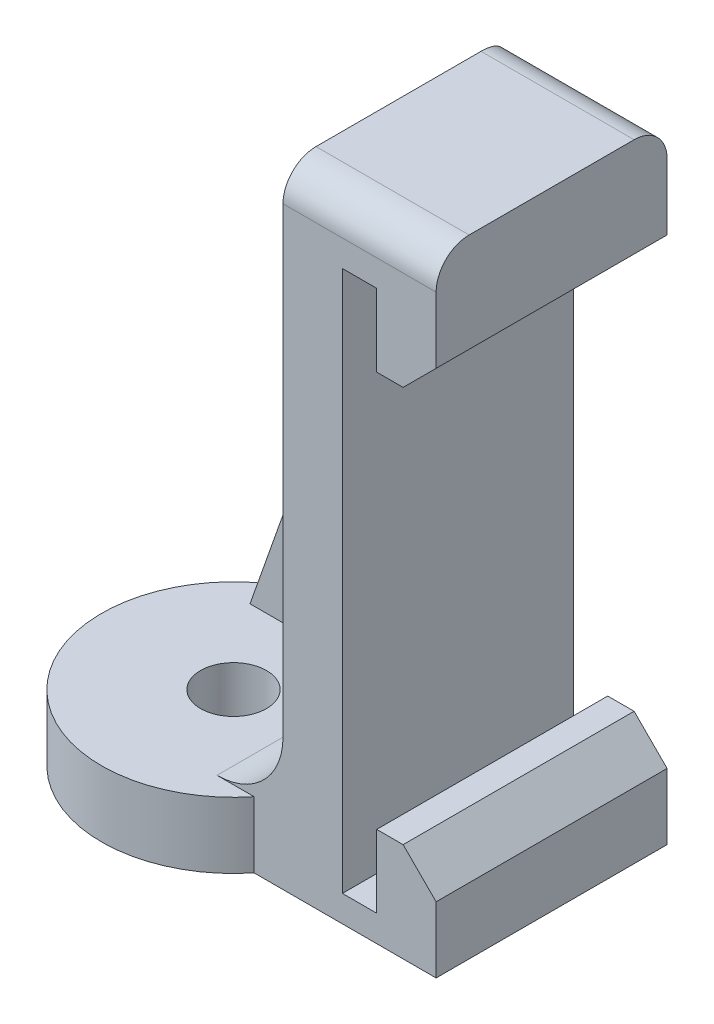
ISO-10303-21;
HEADER;
FILE_DESCRIPTION(('STEP AP214'),'2;1');
FILE_NAME('part.step','',(''),(''),'','','');
FILE_SCHEMA(('AUTOMOTIVE_DESIGN { 1 0 10303 214 1 1 1 1 }'));
ENDSEC;
DATA;
#1=APPLICATION_CONTEXT('core data for automotive mechanical design processes');
#2=APPLICATION_PROTOCOL_DEFINITION('international standard','automotive_design',2000,#1);
#3=PRODUCT_CONTEXT('',#1,'mechanical');
#4=PRODUCT('Part','Part','',(#3));
#5=PRODUCT_RELATED_PRODUCT_CATEGORY('part','',(#4));
#6=PRODUCT_DEFINITION_FORMATION('','',#4);
#7=PRODUCT_DEFINITION_CONTEXT('part definition',#1,'design');
#8=PRODUCT_DEFINITION('design','',#6,#7);
#9=PRODUCT_DEFINITION_SHAPE('','',#8);
#10=(LENGTH_UNIT() NAMED_UNIT(*) SI_UNIT(.MILLI.,.METRE.));
#11=(NAMED_UNIT(*) PLANE_ANGLE_UNIT() SI_UNIT($,.RADIAN.));
#12=(NAMED_UNIT(*) SI_UNIT($,.STERADIAN.) SOLID_ANGLE_UNIT());
#13=UNCERTAINTY_MEASURE_WITH_UNIT(LENGTH_MEASURE(1.E-05),#10,'distance_accuracy_value','');
#14=(GEOMETRIC_REPRESENTATION_CONTEXT(3) GLOBAL_UNCERTAINTY_ASSIGNED_CONTEXT((#13)) GLOBAL_UNIT_ASSIGNED_CONTEXT((#10,
#11,#12)) REPRESENTATION_CONTEXT('',''));
#15=CARTESIAN_POINT('',(0.,0.,0.));
#16=DIRECTION('',(0.,0.,1.));
#17=DIRECTION('',(1.,0.,0.));
#18=AXIS2_PLACEMENT_3D('',#15,#16,#17);
#19=CARTESIAN_POINT('',(1.3335,-0.3175,9.525));
#20=DIRECTION('',(0.,-1.,0.));
#21=DIRECTION('',(0.,0.,-1.));
#22=AXIS2_PLACEMENT_3D('',#19,#20,#21);
#23=PLANE('',#22);
#24=DIRECTION('',(1.,0.,0.));
#25=VECTOR('',#24,1.);
#26=CARTESIAN_POINT('',(1.3335,-0.3175,-1.5875));
#27=LINE('',#26,#25);
#28=CARTESIAN_POINT('',(-0.3175,-0.3175,-1.5875));
#29=VERTEX_POINT('',#28);
#30=CARTESIAN_POINT('',(1.3335,-0.3175,-1.5875));
#31=VERTEX_POINT('',#30);
#32=EDGE_CURVE('E228',#29,#31,#27,.T.);
#33=ORIENTED_EDGE('',*,*,#32,.F.);
#34=DIRECTION('',(0.,0.,-1.));
#35=VECTOR('',#34,1.);
#36=CARTESIAN_POINT('',(-0.3175,-0.3175,9.525));
#37=LINE('',#36,#35);
#38=CARTESIAN_POINT('',(-0.3175,-0.3175,9.525));
#39=VERTEX_POINT('',#38);
#40=EDGE_CURVE('E301',#39,#29,#37,.T.);
#41=ORIENTED_EDGE('',*,*,#40,.F.);
#42=DIRECTION('',(-1.,0.,0.));
#43=VECTOR('',#42,1.);
#44=CARTESIAN_POINT('',(1.3335,-0.3175,9.525));
#45=LINE('',#44,#43);
#46=CARTESIAN_POINT('',(1.3335,-0.3175,9.525));
#47=VERTEX_POINT('',#46);
#48=EDGE_CURVE('E251',#47,#39,#45,.T.);
#49=ORIENTED_EDGE('',*,*,#48,.F.);
#50=DIRECTION('',(0.,0.,-1.));
#51=VECTOR('',#50,1.);
#52=CARTESIAN_POINT('',(1.3335,-0.3175,9.525));
#53=LINE('',#52,#51);
#54=EDGE_CURVE('E277',#47,#31,#53,.T.);
#55=ORIENTED_EDGE('',*,*,#54,.T.);
#56=EDGE_LOOP('',(#33,#41,#49,#55));
#57=FACE_BOUND('',#56,.T.);
#58=ADVANCED_FACE('F35',(#57),#23,.F.);
#59=CARTESIAN_POINT('',(-0.3175,-0.3175,9.525));
#60=DIRECTION('',(-1.,0.,0.));
#61=DIRECTION('',(0.,0.,1.));
#62=AXIS2_PLACEMENT_3D('',#59,#60,#61);
#63=PLANE('',#62);
#64=DIRECTION('',(0.,-1.,0.));
#65=VECTOR('',#64,1.);
#66=CARTESIAN_POINT('',(-0.3175,-0.3175,-1.5875));
#67=LINE('',#66,#65);
#68=CARTESIAN_POINT('',(-0.3175,25.7175,-1.5875));
#69=VERTEX_POINT('',#68);
#70=EDGE_CURVE('E226',#69,#29,#67,.T.);
#71=ORIENTED_EDGE('',*,*,#70,.F.);
#72=DIRECTION('',(0.,0.,-1.));
#73=VECTOR('',#72,1.);
#74=CARTESIAN_POINT('',(-0.3175,25.7175,9.525));
#75=LINE('',#74,#73);
#76=CARTESIAN_POINT('',(-0.3175,25.7175,9.525));
#77=VERTEX_POINT('',#76);
#78=EDGE_CURVE('E298',#77,#69,#75,.T.);
#79=ORIENTED_EDGE('',*,*,#78,.F.);
#80=DIRECTION('',(0.,1.,0.));
#81=VECTOR('',#80,1.);
#82=CARTESIAN_POINT('',(-0.3175,-0.3175,9.525));
#83=LINE('',#82,#81);
#84=EDGE_CURVE('E254',#39,#77,#83,.T.);
#85=ORIENTED_EDGE('',*,*,#84,.F.);
#86=ORIENTED_EDGE('',*,*,#40,.T.);
#87=EDGE_LOOP('',(#71,#79,#85,#86));
#88=FACE_BOUND('',#87,.T.);
#89=ADVANCED_FACE('F380',(#88),#63,.F.);
#90=CARTESIAN_POINT('',(-0.3175,25.7175,9.525));
#91=DIRECTION('',(0.,1.,0.));
#92=DIRECTION('',(0.,0.,1.));
#93=AXIS2_PLACEMENT_3D('',#90,#91,#92);
#94=PLANE('',#93);
#95=DIRECTION('',(-1.,0.,0.));
#96=VECTOR('',#95,1.);
#97=CARTESIAN_POINT('',(-0.3175,25.7175,-1.5875));
#98=LINE('',#97,#96);
#99=CARTESIAN_POINT('',(1.3335,25.7175,-1.5875));
#100=VERTEX_POINT('',#99);
#101=EDGE_CURVE('E224',#100,#69,#98,.T.);
#102=ORIENTED_EDGE('',*,*,#101,.F.);
#103=DIRECTION('',(0.,0.,-1.));
#104=VECTOR('',#103,1.);
#105=CARTESIAN_POINT('',(1.3335,25.7175,9.525));
#106=LINE('',#105,#104);
#107=CARTESIAN_POINT('',(1.3335,25.7175,9.525));
#108=VERTEX_POINT('',#107);
#109=EDGE_CURVE('E295',#108,#100,#106,.T.);
#110=ORIENTED_EDGE('',*,*,#109,.F.);
#111=DIRECTION('',(1.,0.,0.));
#112=VECTOR('',#111,1.);
#113=CARTESIAN_POINT('',(-0.3175,25.7175,9.525));
#114=LINE('',#113,#112);
#115=EDGE_CURVE('E256',#77,#108,#114,.T.);
#116=ORIENTED_EDGE('',*,*,#115,.F.);
#117=ORIENTED_EDGE('',*,*,#78,.T.);
#118=EDGE_LOOP('',(#102,#110,#116,#117));
#119=FACE_BOUND('',#118,.T.);
#120=ADVANCED_FACE('F376',(#119),#94,.F.);
#121=CARTESIAN_POINT('',(1.3335,25.7175,9.525));
#122=DIRECTION('',(1.,0.,0.));
#123=DIRECTION('',(0.,1.,0.));
#124=AXIS2_PLACEMENT_3D('',#121,#122,#123);
#125=PLANE('',#124);
#126=DIRECTION('',(0.,1.,0.));
#127=VECTOR('',#126,1.);
#128=CARTESIAN_POINT('',(1.3335,25.7175,-1.5875));
#129=LINE('',#128,#127);
#130=CARTESIAN_POINT('',(1.3335,22.225,-1.5875));
#131=VERTEX_POINT('',#130);
#132=EDGE_CURVE('E222',#131,#100,#129,.T.);
#133=ORIENTED_EDGE('',*,*,#132,.F.);
#134=DIRECTION('',(0.,0.,-1.));
#135=VECTOR('',#134,1.);
#136=CARTESIAN_POINT('',(1.3335,22.225,9.525));
#137=LINE('',#136,#135);
#138=CARTESIAN_POINT('',(1.3335,22.225,9.525));
#139=VERTEX_POINT('',#138);
#140=EDGE_CURVE('E292',#139,#131,#137,.T.);
#141=ORIENTED_EDGE('',*,*,#140,.F.);
#142=DIRECTION('',(0.,-1.,0.));
#143=VECTOR('',#142,1.);
#144=CARTESIAN_POINT('',(1.3335,25.7175,9.525));
#145=LINE('',#144,#143);
#146=EDGE_CURVE('E258',#108,#139,#145,.T.);
#147=ORIENTED_EDGE('',*,*,#146,.F.);
#148=ORIENTED_EDGE('',*,*,#109,.T.);
#149=EDGE_LOOP('',(#133,#141,#147,#148));
#150=FACE_BOUND('',#149,.T.);
#151=ADVANCED_FACE('F371',(#150),#125,.F.);
#152=CARTESIAN_POINT('',(4.191,22.225,9.525));
#153=DIRECTION('',(0.,1.,0.));
#154=DIRECTION('',(0.,0.,1.));
#155=AXIS2_PLACEMENT_3D('',#152,#153,#154);
#156=PLANE('',#155);
#157=DIRECTION('',(-1.,0.,0.));
#158=VECTOR('',#157,1.);
#159=CARTESIAN_POINT('',(4.191,22.225,-1.5875));
#160=LINE('',#159,#158);
#161=CARTESIAN_POINT('',(2.60349999999999,22.225,-1.5875));
#162=VERTEX_POINT('',#161);
#163=EDGE_CURVE('E220',#162,#131,#160,.T.);
#164=ORIENTED_EDGE('',*,*,#163,.F.);
#165=DIRECTION('',(0.,0.,1.));
#166=VECTOR('',#165,1.);
#167=CARTESIAN_POINT('',(2.60349999999999,22.225,9.525));
#168=LINE('',#167,#166);
#169=CARTESIAN_POINT('',(2.60349999999999,22.225,9.525));
#170=VERTEX_POINT('',#169);
#171=EDGE_CURVE('E325',#162,#170,#168,.T.);
#172=ORIENTED_EDGE('',*,*,#171,.T.);
#173=DIRECTION('',(1.,0.,0.));
#174=VECTOR('',#173,1.);
#175=CARTESIAN_POINT('',(4.191,22.225,9.525));
#176=LINE('',#175,#174);
#177=EDGE_CURVE('E260',#139,#170,#176,.T.);
#178=ORIENTED_EDGE('',*,*,#177,.F.);
#179=ORIENTED_EDGE('',*,*,#140,.T.);
#180=EDGE_LOOP('',(#164,#172,#178,#179));
#181=FACE_BOUND('',#180,.T.);
#182=ADVANCED_FACE('F366',(#181),#156,.F.);
#183=CARTESIAN_POINT('',(4.191,28.575,9.525));
#184=DIRECTION('',(-1.,0.,0.));
#185=DIRECTION('',(0.,0.,1.));
#186=AXIS2_PLACEMENT_3D('',#183,#184,#185);
#187=PLANE('',#186);
#188=DIRECTION('',(0.,-1.,0.));
#189=VECTOR('',#188,1.);
#190=CARTESIAN_POINT('',(4.191,28.575,-1.5875));
#191=LINE('',#190,#189);
#192=CARTESIAN_POINT('',(4.191,26.9875,-1.5875));
#193=VERTEX_POINT('',#192);
#194=CARTESIAN_POINT('',(4.191,23.8125,-1.5875));
#195=VERTEX_POINT('',#194);
#196=EDGE_CURVE('E215',#193,#195,#191,.T.);
#197=ORIENTED_EDGE('',*,*,#196,.F.);
#198=CARTESIAN_POINT('',(4.191,26.9875,0.));
#199=DIRECTION('',(-1.,0.,0.));
#200=DIRECTION('',(0.,0.,1.));
#201=AXIS2_PLACEMENT_3D('',#198,#199,#200);
#202=CIRCLE('',#201,1.5875);
#203=CARTESIAN_POINT('',(4.191,28.575,0.));
#204=VERTEX_POINT('',#203);
#205=EDGE_CURVE('E342',#193,#204,#202,.F.);
#206=ORIENTED_EDGE('',*,*,#205,.T.);
#207=DIRECTION('',(0.,0.,-1.));
#208=VECTOR('',#207,1.);
#209=CARTESIAN_POINT('',(4.191,28.575,9.525));
#210=LINE('',#209,#208);
#211=CARTESIAN_POINT('',(4.191,28.575,7.9375));
#212=VERTEX_POINT('',#211);
#213=EDGE_CURVE('E289',#212,#204,#210,.T.);
#214=ORIENTED_EDGE('',*,*,#213,.F.);
#215=CARTESIAN_POINT('',(4.191,26.9875,7.9375));
#216=DIRECTION('',(-1.,0.,0.));
#217=DIRECTION('',(0.,0.,1.));
#218=AXIS2_PLACEMENT_3D('',#215,#216,#217);
#219=CIRCLE('',#218,1.5875);
#220=CARTESIAN_POINT('',(4.191,26.9875,9.525));
#221=VERTEX_POINT('',#220);
#222=EDGE_CURVE('E329',#212,#221,#219,.F.);
#223=ORIENTED_EDGE('',*,*,#222,.T.);
#224=DIRECTION('',(0.,1.,0.));
#225=VECTOR('',#224,1.);
#226=CARTESIAN_POINT('',(4.191,28.575,9.525));
#227=LINE('',#226,#225);
#228=CARTESIAN_POINT('',(4.191,23.8125,9.525));
#229=VERTEX_POINT('',#228);
#230=EDGE_CURVE('E263',#229,#221,#227,.T.);
#231=ORIENTED_EDGE('',*,*,#230,.F.);
#232=DIRECTION('',(0.,0.,-1.));
#233=VECTOR('',#232,1.);
#234=CARTESIAN_POINT('',(4.191,23.8125,9.525));
#235=LINE('',#234,#233);
#236=EDGE_CURVE('E322',#229,#195,#235,.T.);
#237=ORIENTED_EDGE('',*,*,#236,.T.);
#238=EDGE_LOOP('',(#197,#206,#214,#223,#231,#237));
#239=FACE_BOUND('',#238,.T.);
#240=ADVANCED_FACE('F356',(#239),#187,.F.);
#241=CARTESIAN_POINT('',(1.016,28.575,9.525));
#242=DIRECTION('',(0.,-1.,0.));
#243=DIRECTION('',(0.,0.,-1.));
#244=AXIS2_PLACEMENT_3D('',#241,#242,#243);
#245=PLANE('',#244);
#246=ORIENTED_EDGE('',*,*,#213,.T.);
#247=DIRECTION('',(1.,0.,0.));
#248=VECTOR('',#247,1.);
#249=CARTESIAN_POINT('',(-3.175,28.575,0.));
#250=LINE('',#249,#248);
#251=CARTESIAN_POINT('',(-3.175,28.575,0.));
#252=VERTEX_POINT('',#251);
#253=EDGE_CURVE('E43',#204,#252,#250,.F.);
#254=ORIENTED_EDGE('',*,*,#253,.T.);
#255=DIRECTION('',(0.,0.,-1.));
#256=VECTOR('',#255,1.);
#257=CARTESIAN_POINT('',(-3.175,28.575,1.5875));
#258=LINE('',#257,#256);
#259=CARTESIAN_POINT('',(-3.175,28.575,1.5875));
#260=VERTEX_POINT('',#259);
#261=EDGE_CURVE('E205',#260,#252,#258,.T.);
#262=ORIENTED_EDGE('',*,*,#261,.F.);
#263=DIRECTION('',(0.,0.,-1.));
#264=VECTOR('',#263,1.);
#265=CARTESIAN_POINT('',(-3.175,28.575,9.525));
#266=LINE('',#265,#264);
#267=CARTESIAN_POINT('',(-3.175,28.575,7.9375));
#268=VERTEX_POINT('',#267);
#269=EDGE_CURVE('E287',#268,#260,#266,.T.);
#270=ORIENTED_EDGE('',*,*,#269,.F.);
#271=DIRECTION('',(-1.,0.,0.));
#272=VECTOR('',#271,1.);
#273=CARTESIAN_POINT('',(1.016,28.575,7.9375));
#274=LINE('',#273,#272);
#275=EDGE_CURVE('E327',#268,#212,#274,.F.);
#276=ORIENTED_EDGE('',*,*,#275,.T.);
#277=EDGE_LOOP('',(#246,#254,#262,#270,#276));
#278=FACE_BOUND('',#277,.T.);
#279=ADVANCED_FACE('F346',(#278),#245,.F.);
#280=CARTESIAN_POINT('',(-12.7,-1.5875,9.525));
#281=DIRECTION('',(1.,0.,0.));
#282=DIRECTION('',(0.,0.,-1.));
#283=AXIS2_PLACEMENT_3D('',#280,#281,#282);
#284=PLANE('',#283);
#285=DIRECTION('',(0.,0.,-1.));
#286=VECTOR('',#285,1.);
#287=CARTESIAN_POINT('',(-12.7,-1.5875,9.525));
#288=LINE('',#287,#286);
#289=CARTESIAN_POINT('',(-12.7,-1.5875,0.0569886859688147));
#290=VERTEX_POINT('',#289);
#291=CARTESIAN_POINT('',(-12.7,-1.5875,-1.5875));
#292=VERTEX_POINT('',#291);
#293=EDGE_CURVE('E50',#290,#292,#288,.T.);
#294=ORIENTED_EDGE('',*,*,#293,.F.);
#295=DIRECTION('',(0.,1.,0.));
#296=VECTOR('',#295,1.);
#297=CARTESIAN_POINT('',(-12.7,-1.5875,0.0569886859688156));
#298=LINE('',#297,#296);
#299=CARTESIAN_POINT('',(-12.7,1.5875,0.0569886859688121));
#300=VERTEX_POINT('',#299);
#301=EDGE_CURVE('E190',#290,#300,#298,.T.);
#302=ORIENTED_EDGE('',*,*,#301,.T.);
#303=DIRECTION('',(0.,0.,-1.));
#304=VECTOR('',#303,1.);
#305=CARTESIAN_POINT('',(-12.7,1.5875,1.5875));
#306=LINE('',#305,#304);
#307=CARTESIAN_POINT('',(-12.7,1.5875,-1.5875));
#308=VERTEX_POINT('',#307);
#309=EDGE_CURVE('E178',#300,#308,#306,.T.);
#310=ORIENTED_EDGE('',*,*,#309,.T.);
#311=DIRECTION('',(0.,1.,0.));
#312=VECTOR('',#311,1.);
#313=CARTESIAN_POINT('',(-12.7,-1.5875,-1.5875));
#314=LINE('',#313,#312);
#315=EDGE_CURVE('E196',#292,#308,#314,.T.);
#316=ORIENTED_EDGE('',*,*,#315,.F.);
#317=EDGE_LOOP('',(#294,#302,#310,#316));
#318=FACE_BOUND('',#317,.T.);
#319=ADVANCED_FACE('F191',(#318),#284,.F.);
#320=CARTESIAN_POINT('',(-3.175,-1.5875,9.525));
#321=DIRECTION('',(0.,1.,0.));
#322=DIRECTION('',(0.,0.,1.));
#323=AXIS2_PLACEMENT_3D('',#320,#321,#322);
#324=PLANE('',#323);
#325=CARTESIAN_POINT('',(-9.525,-1.5875,5.55625));
#326=DIRECTION('',(0.,1.,0.));
#327=DIRECTION('',(-1.,0.,0.));
#328=AXIS2_PLACEMENT_3D('',#325,#326,#327);
#329=CIRCLE('',#328,6.35);
#330=CARTESIAN_POINT('',(-4.56803283877127,-1.5875,9.525));
#331=VERTEX_POINT('',#330);
#332=EDGE_CURVE('E207',#290,#331,#329,.T.);
#333=ORIENTED_EDGE('',*,*,#332,.F.);
#334=ORIENTED_EDGE('',*,*,#293,.T.);
#335=DIRECTION('',(-1.,0.,0.));
#336=VECTOR('',#335,1.);
#337=CARTESIAN_POINT('',(4.191,-1.5875,-1.5875));
#338=LINE('',#337,#336);
#339=CARTESIAN_POINT('',(4.191,-1.5875,-1.5875));
#340=VERTEX_POINT('',#339);
#341=EDGE_CURVE('E217',#340,#292,#338,.T.);
#342=ORIENTED_EDGE('',*,*,#341,.F.);
#343=DIRECTION('',(0.,0.,-1.));
#344=VECTOR('',#343,1.);
#345=CARTESIAN_POINT('',(4.191,-1.5875,9.525));
#346=LINE('',#345,#344);
#347=CARTESIAN_POINT('',(4.191,-1.5875,9.525));
#348=VERTEX_POINT('',#347);
#349=EDGE_CURVE('E283',#348,#340,#346,.T.);
#350=ORIENTED_EDGE('',*,*,#349,.F.);
#351=DIRECTION('',(1.,0.,0.));
#352=VECTOR('',#351,1.);
#353=CARTESIAN_POINT('',(-3.175,-1.5875,9.525));
#354=LINE('',#353,#352);
#355=EDGE_CURVE('E268',#331,#348,#354,.T.);
#356=ORIENTED_EDGE('',*,*,#355,.F.);
#357=EDGE_LOOP('',(#333,#334,#342,#350,#356));
#358=FACE_BOUND('',#357,.T.);
#359=CARTESIAN_POINT('',(-9.525,-1.5875,5.55625));
#360=DIRECTION('',(0.,1.,0.));
#361=DIRECTION('',(0.,0.,1.));
#362=AXIS2_PLACEMENT_3D('',#359,#360,#361);
#363=CIRCLE('',#362,1.5875);
#364=CARTESIAN_POINT('',(-9.525,-1.5875,7.14375));
#365=VERTEX_POINT('',#364);
#366=EDGE_CURVE('E240',#365,#365,#363,.F.);
#367=ORIENTED_EDGE('',*,*,#366,.F.);
#368=EDGE_LOOP('',(#367));
#369=FACE_BOUND('',#368,.T.);
#370=ADVANCED_FACE('F408',(#358,#369),#324,.F.);
#371=CARTESIAN_POINT('',(4.191,0.,9.525));
#372=DIRECTION('',(-1.,0.,0.));
#373=DIRECTION('',(0.,0.,1.));
#374=AXIS2_PLACEMENT_3D('',#371,#372,#373);
#375=PLANE('',#374);
#376=CARTESIAN_POINT('',(4.191,1.58750000000001,-1.5875));
#377=VERTEX_POINT('',#376);
#378=EDGE_CURVE('E214',#377,#340,#191,.T.);
#379=ORIENTED_EDGE('',*,*,#378,.F.);
#380=DIRECTION('',(0.,0.,1.));
#381=VECTOR('',#380,1.);
#382=CARTESIAN_POINT('',(4.191,1.58750000000001,9.525));
#383=LINE('',#382,#381);
#384=CARTESIAN_POINT('',(4.191,1.58750000000001,9.525));
#385=VERTEX_POINT('',#384);
#386=EDGE_CURVE('E316',#377,#385,#383,.T.);
#387=ORIENTED_EDGE('',*,*,#386,.T.);
#388=DIRECTION('',(0.,1.,0.));
#389=VECTOR('',#388,1.);
#390=CARTESIAN_POINT('',(4.191,-1.5875,9.525));
#391=LINE('',#390,#389);
#392=EDGE_CURVE('E270',#348,#385,#391,.T.);
#393=ORIENTED_EDGE('',*,*,#392,.F.);
#394=ORIENTED_EDGE('',*,*,#349,.T.);
#395=EDGE_LOOP('',(#379,#387,#393,#394));
#396=FACE_BOUND('',#395,.T.);
#397=ADVANCED_FACE('F403',(#396),#375,.F.);
#398=CARTESIAN_POINT('',(4.191,3.175,9.525));
#399=DIRECTION('',(0.,-1.,0.));
#400=DIRECTION('',(1.,0.,0.));
#401=AXIS2_PLACEMENT_3D('',#398,#399,#400);
#402=PLANE('',#401);
#403=DIRECTION('',(1.,0.,0.));
#404=VECTOR('',#403,1.);
#405=CARTESIAN_POINT('',(4.191,3.175,-1.5875));
#406=LINE('',#405,#404);
#407=CARTESIAN_POINT('',(1.3335,3.175,-1.5875));
#408=VERTEX_POINT('',#407);
#409=CARTESIAN_POINT('',(2.60350000000001,3.175,-1.5875));
#410=VERTEX_POINT('',#409);
#411=EDGE_CURVE('E232',#408,#410,#406,.T.);
#412=ORIENTED_EDGE('',*,*,#411,.F.);
#413=DIRECTION('',(0.,0.,-1.));
#414=VECTOR('',#413,1.);
#415=CARTESIAN_POINT('',(1.3335,3.175,9.525));
#416=LINE('',#415,#414);
#417=CARTESIAN_POINT('',(1.3335,3.175,9.525));
#418=VERTEX_POINT('',#417);
#419=EDGE_CURVE('E280',#418,#408,#416,.T.);
#420=ORIENTED_EDGE('',*,*,#419,.F.);
#421=DIRECTION('',(-1.,0.,0.));
#422=VECTOR('',#421,1.);
#423=CARTESIAN_POINT('',(4.191,3.175,9.525));
#424=LINE('',#423,#422);
#425=CARTESIAN_POINT('',(2.60350000000001,3.175,9.525));
#426=VERTEX_POINT('',#425);
#427=EDGE_CURVE('E273',#426,#418,#424,.T.);
#428=ORIENTED_EDGE('',*,*,#427,.F.);
#429=DIRECTION('',(0.,0.,-1.));
#430=VECTOR('',#429,1.);
#431=CARTESIAN_POINT('',(2.60350000000001,3.175,9.525));
#432=LINE('',#431,#430);
#433=EDGE_CURVE('E313',#426,#410,#432,.T.);
#434=ORIENTED_EDGE('',*,*,#433,.T.);
#435=EDGE_LOOP('',(#412,#420,#428,#434));
#436=FACE_BOUND('',#435,.T.);
#437=ADVANCED_FACE('F393',(#436),#402,.F.);
#438=CARTESIAN_POINT('',(1.3335,3.175,9.525));
#439=DIRECTION('',(1.,0.,0.));
#440=DIRECTION('',(0.,1.,0.));
#441=AXIS2_PLACEMENT_3D('',#438,#439,#440);
#442=PLANE('',#441);
#443=DIRECTION('',(0.,1.,0.));
#444=VECTOR('',#443,1.);
#445=CARTESIAN_POINT('',(1.3335,3.175,-1.5875));
#446=LINE('',#445,#444);
#447=EDGE_CURVE('E230',#31,#408,#446,.T.);
#448=ORIENTED_EDGE('',*,*,#447,.F.);
#449=ORIENTED_EDGE('',*,*,#54,.F.);
#450=DIRECTION('',(0.,-1.,0.));
#451=VECTOR('',#450,1.);
#452=CARTESIAN_POINT('',(1.3335,3.175,9.525));
#453=LINE('',#452,#451);
#454=EDGE_CURVE('E275',#418,#47,#453,.T.);
#455=ORIENTED_EDGE('',*,*,#454,.F.);
#456=ORIENTED_EDGE('',*,*,#419,.T.);
#457=EDGE_LOOP('',(#448,#449,#455,#456));
#458=FACE_BOUND('',#457,.T.);
#459=ADVANCED_FACE('F389',(#458),#442,.F.);
#460=CARTESIAN_POINT('',(2.60350000000001,3.175,9.525));
#461=DIRECTION('',(-0.707106781186548,-0.707106781186547,0.));
#462=DIRECTION('',(0.,0.,-1.));
#463=AXIS2_PLACEMENT_3D('',#460,#461,#462);
#464=PLANE('',#463);
#465=ORIENTED_EDGE('',*,*,#386,.F.);
#466=DIRECTION('',(0.707106781186547,-0.707106781186548,0.));
#467=VECTOR('',#466,1.);
#468=CARTESIAN_POINT('',(2.60350000000001,3.175,-1.5875));
#469=LINE('',#468,#467);
#470=EDGE_CURVE('E234',#377,#410,#469,.F.);
#471=ORIENTED_EDGE('',*,*,#470,.T.);
#472=ORIENTED_EDGE('',*,*,#433,.F.);
#473=DIRECTION('',(0.707106781186547,-0.707106781186548,0.));
#474=VECTOR('',#473,1.);
#475=CARTESIAN_POINT('',(2.60350000000001,3.175,9.525));
#476=LINE('',#475,#474);
#477=EDGE_CURVE('E320',#385,#426,#476,.F.);
#478=ORIENTED_EDGE('',*,*,#477,.F.);
#479=EDGE_LOOP('',(#465,#471,#472,#478));
#480=FACE_BOUND('',#479,.T.);
#481=ADVANCED_FACE('F399',(#480),#464,.F.);
#482=CARTESIAN_POINT('',(4.191,23.8125,9.525));
#483=DIRECTION('',(-0.707106781186545,0.70710678118655,0.));
#484=DIRECTION('',(0.,0.,-1.));
#485=AXIS2_PLACEMENT_3D('',#482,#483,#484);
#486=PLANE('',#485);
#487=ORIENTED_EDGE('',*,*,#171,.F.);
#488=DIRECTION('',(-0.70710678118655,-0.707106781186545,0.));
#489=VECTOR('',#488,1.);
#490=CARTESIAN_POINT('',(4.191,23.8125,-1.5875));
#491=LINE('',#490,#489);
#492=EDGE_CURVE('E336',#162,#195,#491,.F.);
#493=ORIENTED_EDGE('',*,*,#492,.T.);
#494=ORIENTED_EDGE('',*,*,#236,.F.);
#495=DIRECTION('',(-0.70710678118655,-0.707106781186545,0.));
#496=VECTOR('',#495,1.);
#497=CARTESIAN_POINT('',(4.191,23.8125,9.525));
#498=LINE('',#497,#496);
#499=EDGE_CURVE('E318',#170,#229,#498,.F.);
#500=ORIENTED_EDGE('',*,*,#499,.F.);
#501=EDGE_LOOP('',(#487,#493,#494,#500));
#502=FACE_BOUND('',#501,.T.);
#503=ADVANCED_FACE('F362',(#502),#486,.F.);
#504=CARTESIAN_POINT('',(-3.175,28.575,9.525));
#505=DIRECTION('',(1.,0.,0.));
#506=DIRECTION('',(0.,1.,0.));
#507=AXIS2_PLACEMENT_3D('',#504,#505,#506);
#508=PLANE('',#507);
#509=DIRECTION('',(0.,-1.,0.));
#510=VECTOR('',#509,1.);
#511=CARTESIAN_POINT('',(-3.175,28.575,9.525));
#512=LINE('',#511,#510);
#513=CARTESIAN_POINT('',(-3.175,26.9875,9.525));
#514=VERTEX_POINT('',#513);
#515=CARTESIAN_POINT('',(-3.175,4.7625,9.525));
#516=VERTEX_POINT('',#515);
#517=EDGE_CURVE('E266',#514,#516,#512,.T.);
#518=ORIENTED_EDGE('',*,*,#517,.F.);
#519=CARTESIAN_POINT('',(-3.175,26.9875,7.9375));
#520=DIRECTION('',(1.,0.,0.));
#521=DIRECTION('',(0.,1.,0.));
#522=AXIS2_PLACEMENT_3D('',#519,#520,#521);
#523=CIRCLE('',#522,1.5875);
#524=EDGE_CURVE('E334',#514,#268,#523,.F.);
#525=ORIENTED_EDGE('',*,*,#524,.T.);
#526=ORIENTED_EDGE('',*,*,#269,.T.);
#527=DIRECTION('',(0.,1.,0.));
#528=VECTOR('',#527,1.);
#529=CARTESIAN_POINT('',(-3.175,1.5875,1.5875));
#530=LINE('',#529,#528);
#531=CARTESIAN_POINT('',(-3.175,4.7625,1.5875));
#532=VERTEX_POINT('',#531);
#533=EDGE_CURVE('E243',#532,#260,#530,.T.);
#534=ORIENTED_EDGE('',*,*,#533,.F.);
#535=DIRECTION('',(0.,0.,-1.));
#536=VECTOR('',#535,1.);
#537=CARTESIAN_POINT('',(-3.175,4.7625,9.525));
#538=LINE('',#537,#536);
#539=EDGE_CURVE('E306',#532,#516,#538,.F.);
#540=ORIENTED_EDGE('',*,*,#539,.T.);
#541=EDGE_LOOP('',(#518,#525,#526,#534,#540));
#542=FACE_BOUND('',#541,.T.);
#543=ADVANCED_FACE('F418',(#542),#508,.F.);
#544=CARTESIAN_POINT('',(-12.7,1.5875,9.525));
#545=DIRECTION('',(0.,-1.,0.));
#546=DIRECTION('',(1.,0.,0.));
#547=AXIS2_PLACEMENT_3D('',#544,#545,#546);
#548=PLANE('',#547);
#549=DIRECTION('',(1.,0.,0.));
#550=VECTOR('',#549,1.);
#551=CARTESIAN_POINT('',(-12.7,1.5875,1.5875));
#552=LINE('',#551,#550);
#553=CARTESIAN_POINT('',(-12.7,1.5875,1.5875));
#554=VERTEX_POINT('',#553);
#555=CARTESIAN_POINT('',(-6.35,1.5875,1.5875));
#556=VERTEX_POINT('',#555);
#557=EDGE_CURVE('E188',#554,#556,#552,.T.);
#558=ORIENTED_EDGE('',*,*,#557,.F.);
#559=EDGE_CURVE('E183',#554,#300,#306,.T.);
#560=ORIENTED_EDGE('',*,*,#559,.T.);
#561=CARTESIAN_POINT('',(-9.525,1.5875,5.55625));
#562=DIRECTION('',(0.,1.,0.));
#563=DIRECTION('',(-1.,0.,0.));
#564=AXIS2_PLACEMENT_3D('',#561,#562,#563);
#565=CIRCLE('',#564,6.35);
#566=CARTESIAN_POINT('',(-4.56803283877127,1.5875,9.525));
#567=VERTEX_POINT('',#566);
#568=EDGE_CURVE('E203',#300,#567,#565,.T.);
#569=ORIENTED_EDGE('',*,*,#568,.T.);
#570=DIRECTION('',(1.,0.,0.));
#571=VECTOR('',#570,1.);
#572=CARTESIAN_POINT('',(0.,1.5875,9.525));
#573=LINE('',#572,#571);
#574=CARTESIAN_POINT('',(-6.35,1.5875,9.525));
#575=VERTEX_POINT('',#574);
#576=EDGE_CURVE('E58',#575,#567,#573,.T.);
#577=ORIENTED_EDGE('',*,*,#576,.F.);
#578=DIRECTION('',(0.,0.,-1.));
#579=VECTOR('',#578,1.);
#580=CARTESIAN_POINT('',(-6.35,1.5875,-9.525));
#581=LINE('',#580,#579);
#582=EDGE_CURVE('E304',#575,#556,#581,.T.);
#583=ORIENTED_EDGE('',*,*,#582,.T.);
#584=EDGE_LOOP('',(#558,#560,#569,#577,#583));
#585=FACE_BOUND('',#584,.T.);
#586=CARTESIAN_POINT('',(-9.525,1.5875,5.55625));
#587=DIRECTION('',(0.,1.,0.));
#588=DIRECTION('',(-1.,0.,0.));
#589=AXIS2_PLACEMENT_3D('',#586,#587,#588);
#590=CIRCLE('',#589,1.5875);
#591=CARTESIAN_POINT('',(-11.1125,1.5875,5.55625));
#592=VERTEX_POINT('',#591);
#593=EDGE_CURVE('E237',#592,#592,#590,.T.);
#594=ORIENTED_EDGE('',*,*,#593,.F.);
#595=EDGE_LOOP('',(#594));
#596=FACE_BOUND('',#595,.T.);
#597=ADVANCED_FACE('F201',(#585,#596),#548,.F.);
#598=CARTESIAN_POINT('',(-6.35,4.7625,9.525));
#599=DIRECTION('',(0.,0.,1.));
#600=DIRECTION('',(1.,0.,0.));
#601=AXIS2_PLACEMENT_3D('',#598,#599,#600);
#602=CYLINDRICAL_SURFACE('',#601,3.175);
#603=CARTESIAN_POINT('',(-6.35,4.7625,1.5875));
#604=DIRECTION('',(0.,0.,-1.));
#605=DIRECTION('',(-1.,0.,0.));
#606=AXIS2_PLACEMENT_3D('',#603,#604,#605);
#607=CIRCLE('',#606,3.175);
#608=EDGE_CURVE('E311',#556,#532,#607,.F.);
#609=ORIENTED_EDGE('',*,*,#608,.F.);
#610=ORIENTED_EDGE('',*,*,#582,.F.);
#611=CARTESIAN_POINT('',(-6.35,4.7625,9.525));
#612=DIRECTION('',(0.,0.,-1.));
#613=DIRECTION('',(-1.,0.,0.));
#614=AXIS2_PLACEMENT_3D('',#611,#612,#613);
#615=CIRCLE('',#614,3.175);
#616=EDGE_CURVE('E309',#516,#575,#615,.T.);
#617=ORIENTED_EDGE('',*,*,#616,.F.);
#618=ORIENTED_EDGE('',*,*,#539,.F.);
#619=EDGE_LOOP('',(#609,#610,#617,#618));
#620=FACE_BOUND('',#619,.T.);
#621=ADVANCED_FACE('F425',(#620),#602,.F.);
#622=CARTESIAN_POINT('',(0.,0.,9.525));
#623=DIRECTION('',(0.,0.,-1.));
#624=DIRECTION('',(-1.,0.,0.));
#625=AXIS2_PLACEMENT_3D('',#622,#623,#624);
#626=PLANE('',#625);
#627=ORIENTED_EDGE('',*,*,#576,.T.);
#628=DIRECTION('',(0.,1.,0.));
#629=VECTOR('',#628,1.);
#630=CARTESIAN_POINT('',(-4.56803283877127,-1.5875,9.525));
#631=LINE('',#630,#629);
#632=EDGE_CURVE('E197',#567,#331,#631,.F.);
#633=ORIENTED_EDGE('',*,*,#632,.T.);
#634=ORIENTED_EDGE('',*,*,#355,.T.);
#635=ORIENTED_EDGE('',*,*,#392,.T.);
#636=ORIENTED_EDGE('',*,*,#477,.T.);
#637=ORIENTED_EDGE('',*,*,#427,.T.);
#638=ORIENTED_EDGE('',*,*,#454,.T.);
#639=ORIENTED_EDGE('',*,*,#48,.T.);
#640=ORIENTED_EDGE('',*,*,#84,.T.);
#641=ORIENTED_EDGE('',*,*,#115,.T.);
#642=ORIENTED_EDGE('',*,*,#146,.T.);
#643=ORIENTED_EDGE('',*,*,#177,.T.);
#644=ORIENTED_EDGE('',*,*,#499,.T.);
#645=ORIENTED_EDGE('',*,*,#230,.T.);
#646=DIRECTION('',(-1.,0.,0.));
#647=VECTOR('',#646,1.);
#648=CARTESIAN_POINT('',(0.,26.9875,9.525));
#649=LINE('',#648,#647);
#650=EDGE_CURVE('E331',#221,#514,#649,.T.);
#651=ORIENTED_EDGE('',*,*,#650,.T.);
#652=ORIENTED_EDGE('',*,*,#517,.T.);
#653=ORIENTED_EDGE('',*,*,#616,.T.);
#654=EDGE_LOOP('',(#627,#633,#634,#635,#636,#637,#638,#639,#640,#641,#642,#643,#644,#645,#651,
#652,#653));
#655=FACE_BOUND('',#654,.T.);
#656=ADVANCED_FACE('F410',(#655),#626,.F.);
#657=CARTESIAN_POINT('',(0.,0.,1.5875));
#658=DIRECTION('',(0.,0.,-1.));
#659=DIRECTION('',(-1.,0.,0.));
#660=AXIS2_PLACEMENT_3D('',#657,#658,#659);
#661=PLANE('',#660);
#662=ORIENTED_EDGE('',*,*,#557,.T.);
#663=ORIENTED_EDGE('',*,*,#608,.T.);
#664=ORIENTED_EDGE('',*,*,#533,.T.);
#665=DIRECTION('',(-0.332820117735137,-0.94299033358289,0.));
#666=VECTOR('',#665,1.);
#667=CARTESIAN_POINT('',(-3.175,28.575,1.5875));
#668=LINE('',#667,#666);
#669=EDGE_CURVE('E246',#260,#554,#668,.T.);
#670=ORIENTED_EDGE('',*,*,#669,.T.);
#671=EDGE_LOOP('',(#662,#663,#664,#670));
#672=FACE_BOUND('',#671,.T.);
#673=ADVANCED_FACE('F427',(#672),#661,.F.);
#674=CARTESIAN_POINT('',(0.,0.,-1.5875));
#675=DIRECTION('',(0.,0.,-1.));
#676=DIRECTION('',(-1.,0.,0.));
#677=AXIS2_PLACEMENT_3D('',#674,#675,#676);
#678=PLANE('',#677);
#679=DIRECTION('',(-0.332820117735137,-0.94299033358289,0.));
#680=VECTOR('',#679,1.);
#681=CARTESIAN_POINT('',(-3.175,28.575,-1.5875));
#682=LINE('',#681,#680);
#683=CARTESIAN_POINT('',(-3.73529411764706,26.9875,-1.5875));
#684=VERTEX_POINT('',#683);
#685=EDGE_CURVE('E186',#684,#308,#682,.T.);
#686=ORIENTED_EDGE('',*,*,#685,.F.);
#687=DIRECTION('',(1.,0.,0.));
#688=VECTOR('',#687,1.);
#689=CARTESIAN_POINT('',(4.191,26.9875,-1.5875));
#690=LINE('',#689,#688);
#691=EDGE_CURVE('E339',#684,#193,#690,.T.);
#692=ORIENTED_EDGE('',*,*,#691,.T.);
#693=ORIENTED_EDGE('',*,*,#196,.T.);
#694=ORIENTED_EDGE('',*,*,#492,.F.);
#695=ORIENTED_EDGE('',*,*,#163,.T.);
#696=ORIENTED_EDGE('',*,*,#132,.T.);
#697=ORIENTED_EDGE('',*,*,#101,.T.);
#698=ORIENTED_EDGE('',*,*,#70,.T.);
#699=ORIENTED_EDGE('',*,*,#32,.T.);
#700=ORIENTED_EDGE('',*,*,#447,.T.);
#701=ORIENTED_EDGE('',*,*,#411,.T.);
#702=ORIENTED_EDGE('',*,*,#470,.F.);
#703=ORIENTED_EDGE('',*,*,#378,.T.);
#704=ORIENTED_EDGE('',*,*,#341,.T.);
#705=ORIENTED_EDGE('',*,*,#315,.T.);
#706=EDGE_LOOP('',(#686,#692,#693,#694,#695,#696,#697,#698,#699,#700,#701,#702,#703,#704,#705));
#707=FACE_BOUND('',#706,.T.);
#708=ADVANCED_FACE('F354',(#707),#678,.T.);
#709=CARTESIAN_POINT('',(-3.175,28.575,1.5875));
#710=DIRECTION('',(0.94299033358289,-0.332820117735137,0.));
#711=DIRECTION('',(0.332820117735137,0.94299033358289,0.));
#712=AXIS2_PLACEMENT_3D('',#709,#710,#711);
#713=PLANE('',#712);
#714=ORIENTED_EDGE('',*,*,#261,.T.);
#715=CARTESIAN_POINT('',(-3.73529411764706,26.9875,0.));
#716=DIRECTION('',(0.94299033358289,-0.332820117735137,0.));
#717=DIRECTION('',(-0.332820117735137,-0.94299033358289,0.));
#718=AXIS2_PLACEMENT_3D('',#715,#716,#717);
#719=ELLIPSE('',#718,1.68347430876444,1.5875);
#720=EDGE_CURVE('E11',#252,#684,#719,.F.);
#721=ORIENTED_EDGE('',*,*,#720,.T.);
#722=ORIENTED_EDGE('',*,*,#685,.T.);
#723=ORIENTED_EDGE('',*,*,#309,.F.);
#724=ORIENTED_EDGE('',*,*,#559,.F.);
#725=ORIENTED_EDGE('',*,*,#669,.F.);
#726=EDGE_LOOP('',(#714,#721,#722,#723,#724,#725));
#727=FACE_BOUND('',#726,.T.);
#728=ADVANCED_FACE('F180',(#727),#713,.F.);
#729=CARTESIAN_POINT('',(-9.525,-6.07762806053458,5.55625));
#730=DIRECTION('',(0.,1.,0.));
#731=DIRECTION('',(-1.,0.,0.));
#732=AXIS2_PLACEMENT_3D('',#729,#730,#731);
#733=CYLINDRICAL_SURFACE('',#732,1.5875);
#734=ORIENTED_EDGE('',*,*,#366,.T.);
#735=EDGE_LOOP('',(#734));
#736=FACE_BOUND('',#735,.T.);
#737=ORIENTED_EDGE('',*,*,#593,.T.);
#738=EDGE_LOOP('',(#737));
#739=FACE_BOUND('',#738,.T.);
#740=ADVANCED_FACE('F451',(#736,#739),#733,.F.);
#741=CARTESIAN_POINT('',(0.,26.9875,7.9375));
#742=DIRECTION('',(-1.,0.,0.));
#743=DIRECTION('',(0.,0.,1.));
#744=AXIS2_PLACEMENT_3D('',#741,#742,#743);
#745=CYLINDRICAL_SURFACE('',#744,1.5875);
#746=ORIENTED_EDGE('',*,*,#222,.F.);
#747=ORIENTED_EDGE('',*,*,#275,.F.);
#748=ORIENTED_EDGE('',*,*,#524,.F.);
#749=ORIENTED_EDGE('',*,*,#650,.F.);
#750=EDGE_LOOP('',(#746,#747,#748,#749));
#751=FACE_BOUND('',#750,.T.);
#752=ADVANCED_FACE('F415',(#751),#745,.T.);
#753=CARTESIAN_POINT('',(0.,26.9875,0.));
#754=DIRECTION('',(-1.,0.,0.));
#755=DIRECTION('',(0.,0.,1.));
#756=AXIS2_PLACEMENT_3D('',#753,#754,#755);
#757=CYLINDRICAL_SURFACE('',#756,1.5875);
#758=ORIENTED_EDGE('',*,*,#720,.F.);
#759=ORIENTED_EDGE('',*,*,#253,.F.);
#760=ORIENTED_EDGE('',*,*,#205,.F.);
#761=ORIENTED_EDGE('',*,*,#691,.F.);
#762=EDGE_LOOP('',(#758,#759,#760,#761));
#763=FACE_BOUND('',#762,.T.);
#764=ADVANCED_FACE('F37',(#763),#757,.T.);
#765=CARTESIAN_POINT('',(-9.525,-1.5875,5.55625));
#766=DIRECTION('',(0.,1.,0.));
#767=DIRECTION('',(-1.,0.,0.));
#768=AXIS2_PLACEMENT_3D('',#765,#766,#767);
#769=CYLINDRICAL_SURFACE('',#768,6.35);
#770=ORIENTED_EDGE('',*,*,#301,.F.);
#771=ORIENTED_EDGE('',*,*,#332,.T.);
#772=ORIENTED_EDGE('',*,*,#632,.F.);
#773=ORIENTED_EDGE('',*,*,#568,.F.);
#774=EDGE_LOOP('',(#770,#771,#772,#773));
#775=FACE_BOUND('',#774,.T.);
#776=ADVANCED_FACE('F206',(#775),#769,.T.);
#777=CLOSED_SHELL('',(#58,#89,#120,#151,#182,#240,#279,#319,#370,#397,#437,#459,#481,#503,#543,
#597,#621,#656,#673,#708,#728,#740,#752,#764,#776));
#778=MANIFOLD_SOLID_BREP('B2',#777);
#779=ADVANCED_BREP_SHAPE_REPRESENTATION('',(#18,#778),#14);
#780=SHAPE_DEFINITION_REPRESENTATION(#9,#779);
ENDSEC;
END-ISO-10303-21;
